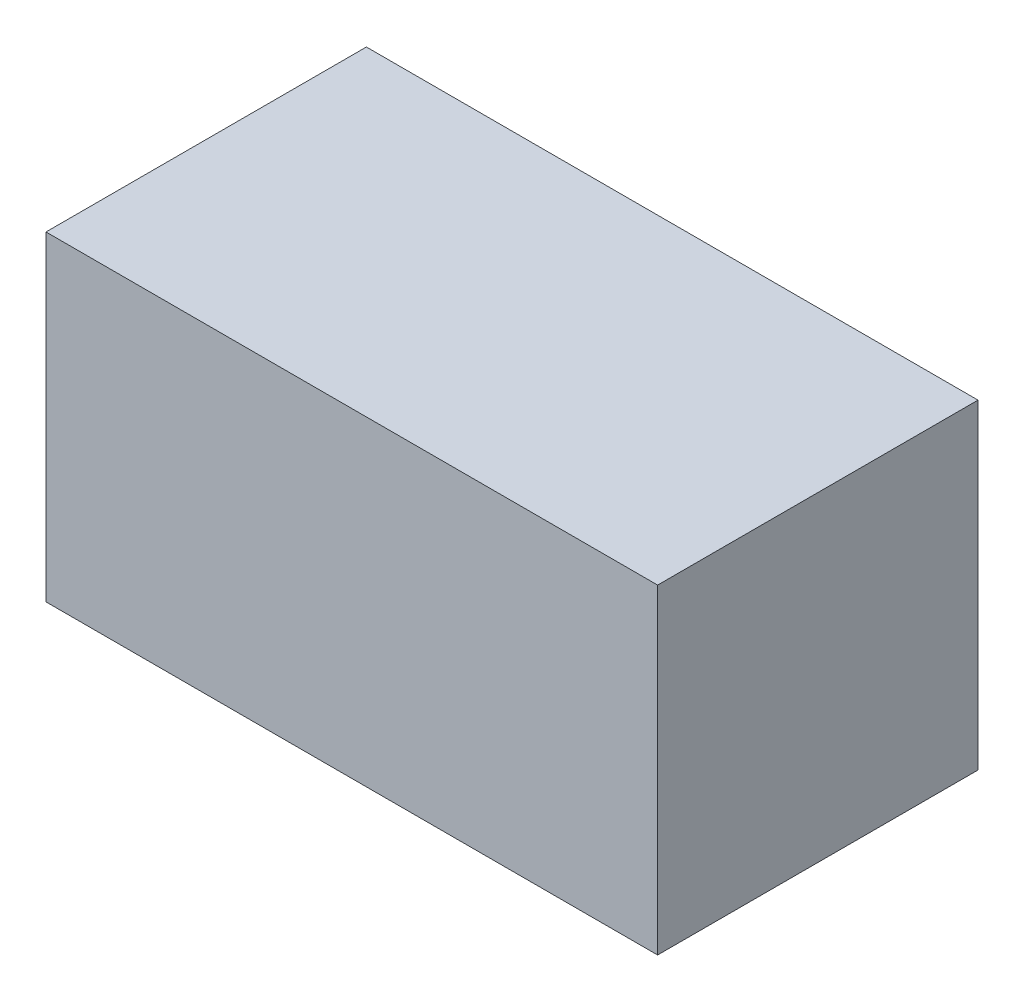
ISO-10303-21;
HEADER;
FILE_DESCRIPTION(('STEP AP214'),'2;1');
FILE_NAME('part.step','',(''),(''),'','','');
FILE_SCHEMA(('AUTOMOTIVE_DESIGN { 1 0 10303 214 1 1 1 1 }'));
ENDSEC;
DATA;
#1=APPLICATION_CONTEXT('core data for automotive mechanical design processes');
#2=APPLICATION_PROTOCOL_DEFINITION('international standard','automotive_design',2000,#1);
#3=PRODUCT_CONTEXT('',#1,'mechanical');
#4=PRODUCT('Part','Part','',(#3));
#5=PRODUCT_RELATED_PRODUCT_CATEGORY('part','',(#4));
#6=PRODUCT_DEFINITION_FORMATION('','',#4);
#7=PRODUCT_DEFINITION_CONTEXT('part definition',#1,'design');
#8=PRODUCT_DEFINITION('design','',#6,#7);
#9=PRODUCT_DEFINITION_SHAPE('','',#8);
#10=(LENGTH_UNIT() NAMED_UNIT(*) SI_UNIT(.MILLI.,.METRE.));
#11=(NAMED_UNIT(*) PLANE_ANGLE_UNIT() SI_UNIT($,.RADIAN.));
#12=(NAMED_UNIT(*) SI_UNIT($,.STERADIAN.) SOLID_ANGLE_UNIT());
#13=UNCERTAINTY_MEASURE_WITH_UNIT(LENGTH_MEASURE(1.E-05),#10,'distance_accuracy_value','');
#14=(GEOMETRIC_REPRESENTATION_CONTEXT(3) GLOBAL_UNCERTAINTY_ASSIGNED_CONTEXT((#13)) GLOBAL_UNIT_ASSIGNED_CONTEXT((#10,
#11,#12)) REPRESENTATION_CONTEXT('',''));
#15=CARTESIAN_POINT('',(0.,0.,0.));
#16=DIRECTION('',(0.,0.,1.));
#17=DIRECTION('',(1.,0.,0.));
#18=AXIS2_PLACEMENT_3D('',#15,#16,#17);
#19=CARTESIAN_POINT('',(-0.3149981,0.16500094,0.));
#20=DIRECTION('',(1.,0.,0.));
#21=DIRECTION('',(0.,-1.,0.));
#22=AXIS2_PLACEMENT_3D('',#19,#20,#21);
#23=PLANE('',#22);
#24=DIRECTION('',(0.,-1.,0.));
#25=VECTOR('',#24,1.);
#26=CARTESIAN_POINT('',(-0.3149981,0.16500094,0.));
#27=LINE('',#26,#25);
#28=CARTESIAN_POINT('',(-0.3149981,0.16500094,0.));
#29=VERTEX_POINT('',#28);
#30=CARTESIAN_POINT('',(-0.3149981,-0.16500094,0.));
#31=VERTEX_POINT('',#30);
#32=EDGE_CURVE('E11',#29,#31,#27,.T.);
#33=ORIENTED_EDGE('',*,*,#32,.T.);
#34=DIRECTION('',(0.,0.,1.));
#35=VECTOR('',#34,1.);
#36=CARTESIAN_POINT('',(-0.3149981,-0.16500094,0.));
#37=LINE('',#36,#35);
#38=CARTESIAN_POINT('',(-0.3149981,-0.16500094,0.32999934));
#39=VERTEX_POINT('',#38);
#40=EDGE_CURVE('E24',#31,#39,#37,.T.);
#41=ORIENTED_EDGE('',*,*,#40,.T.);
#42=DIRECTION('',(0.,-1.,0.));
#43=VECTOR('',#42,1.);
#44=CARTESIAN_POINT('',(-0.3149981,0.16500094,0.32999934));
#45=LINE('',#44,#43);
#46=CARTESIAN_POINT('',(-0.3149981,0.16500094,0.32999934));
#47=VERTEX_POINT('',#46);
#48=EDGE_CURVE('E87',#47,#39,#45,.T.);
#49=ORIENTED_EDGE('',*,*,#48,.F.);
#50=DIRECTION('',(0.,0.,1.));
#51=VECTOR('',#50,1.);
#52=CARTESIAN_POINT('',(-0.3149981,0.16500094,0.));
#53=LINE('',#52,#51);
#54=EDGE_CURVE('E36',#29,#47,#53,.T.);
#55=ORIENTED_EDGE('',*,*,#54,.F.);
#56=EDGE_LOOP('',(#33,#41,#49,#55));
#57=FACE_BOUND('',#56,.T.);
#58=ADVANCED_FACE('F17',(#57),#23,.F.);
#59=CARTESIAN_POINT('',(-0.3149981,-0.16500094,0.));
#60=DIRECTION('',(0.,1.,0.));
#61=DIRECTION('',(1.,0.,0.));
#62=AXIS2_PLACEMENT_3D('',#59,#60,#61);
#63=PLANE('',#62);
#64=DIRECTION('',(1.,0.,0.));
#65=VECTOR('',#64,1.);
#66=CARTESIAN_POINT('',(-0.3149981,-0.16500094,0.));
#67=LINE('',#66,#65);
#68=CARTESIAN_POINT('',(0.31500064,-0.16500094,0.));
#69=VERTEX_POINT('',#68);
#70=EDGE_CURVE('E84',#31,#69,#67,.T.);
#71=ORIENTED_EDGE('',*,*,#70,.T.);
#72=DIRECTION('',(0.,0.,1.));
#73=VECTOR('',#72,1.);
#74=CARTESIAN_POINT('',(0.31500064,-0.16500094,0.));
#75=LINE('',#74,#73);
#76=CARTESIAN_POINT('',(0.31500064,-0.16500094,0.32999934));
#77=VERTEX_POINT('',#76);
#78=EDGE_CURVE('E82',#69,#77,#75,.T.);
#79=ORIENTED_EDGE('',*,*,#78,.T.);
#80=DIRECTION('',(1.,0.,0.));
#81=VECTOR('',#80,1.);
#82=CARTESIAN_POINT('',(-0.3149981,-0.16500094,0.32999934));
#83=LINE('',#82,#81);
#84=EDGE_CURVE('E69',#39,#77,#83,.T.);
#85=ORIENTED_EDGE('',*,*,#84,.F.);
#86=ORIENTED_EDGE('',*,*,#40,.F.);
#87=EDGE_LOOP('',(#71,#79,#85,#86));
#88=FACE_BOUND('',#87,.T.);
#89=ADVANCED_FACE('F89',(#88),#63,.F.);
#90=CARTESIAN_POINT('',(0.31500064,-0.16500094,0.));
#91=DIRECTION('',(-1.,0.,0.));
#92=DIRECTION('',(0.,1.,0.));
#93=AXIS2_PLACEMENT_3D('',#90,#91,#92);
#94=PLANE('',#93);
#95=DIRECTION('',(0.,1.,0.));
#96=VECTOR('',#95,1.);
#97=CARTESIAN_POINT('',(0.31500064,-0.16500094,0.));
#98=LINE('',#97,#96);
#99=CARTESIAN_POINT('',(0.31500064,0.16500094,0.));
#100=VERTEX_POINT('',#99);
#101=EDGE_CURVE('E75',#69,#100,#98,.T.);
#102=ORIENTED_EDGE('',*,*,#101,.T.);
#103=DIRECTION('',(0.,0.,1.));
#104=VECTOR('',#103,1.);
#105=CARTESIAN_POINT('',(0.31500064,0.16500094,0.));
#106=LINE('',#105,#104);
#107=CARTESIAN_POINT('',(0.31500064,0.16500094,0.32999934));
#108=VERTEX_POINT('',#107);
#109=EDGE_CURVE('E62',#100,#108,#106,.T.);
#110=ORIENTED_EDGE('',*,*,#109,.T.);
#111=DIRECTION('',(0.,1.,0.));
#112=VECTOR('',#111,1.);
#113=CARTESIAN_POINT('',(0.31500064,-0.16500094,0.32999934));
#114=LINE('',#113,#112);
#115=EDGE_CURVE('E67',#77,#108,#114,.T.);
#116=ORIENTED_EDGE('',*,*,#115,.F.);
#117=ORIENTED_EDGE('',*,*,#78,.F.);
#118=EDGE_LOOP('',(#102,#110,#116,#117));
#119=FACE_BOUND('',#118,.T.);
#120=ADVANCED_FACE('F73',(#119),#94,.F.);
#121=CARTESIAN_POINT('',(0.31500064,0.16500094,0.));
#122=DIRECTION('',(0.,-1.,0.));
#123=DIRECTION('',(-1.,0.,0.));
#124=AXIS2_PLACEMENT_3D('',#121,#122,#123);
#125=PLANE('',#124);
#126=DIRECTION('',(-1.,0.,0.));
#127=VECTOR('',#126,1.);
#128=CARTESIAN_POINT('',(0.31500064,0.16500094,0.));
#129=LINE('',#128,#127);
#130=EDGE_CURVE('E64',#100,#29,#129,.T.);
#131=ORIENTED_EDGE('',*,*,#130,.T.);
#132=ORIENTED_EDGE('',*,*,#54,.T.);
#133=DIRECTION('',(-1.,0.,0.));
#134=VECTOR('',#133,1.);
#135=CARTESIAN_POINT('',(0.31500064,0.16500094,0.32999934));
#136=LINE('',#135,#134);
#137=EDGE_CURVE('E57',#108,#47,#136,.T.);
#138=ORIENTED_EDGE('',*,*,#137,.F.);
#139=ORIENTED_EDGE('',*,*,#109,.F.);
#140=EDGE_LOOP('',(#131,#132,#138,#139));
#141=FACE_BOUND('',#140,.T.);
#142=ADVANCED_FACE('F60',(#141),#125,.F.);
#143=CARTESIAN_POINT('',(-0.3149981,0.16500094,0.));
#144=DIRECTION('',(0.,0.,-1.));
#145=DIRECTION('',(-1.,0.,0.));
#146=AXIS2_PLACEMENT_3D('',#143,#144,#145);
#147=PLANE('',#146);
#148=ORIENTED_EDGE('',*,*,#130,.F.);
#149=ORIENTED_EDGE('',*,*,#101,.F.);
#150=ORIENTED_EDGE('',*,*,#70,.F.);
#151=ORIENTED_EDGE('',*,*,#32,.F.);
#152=EDGE_LOOP('',(#148,#149,#150,#151));
#153=FACE_BOUND('',#152,.T.);
#154=ADVANCED_FACE('F91',(#153),#147,.T.);
#155=CARTESIAN_POINT('',(-0.3149981,0.16500094,0.32999934));
#156=DIRECTION('',(0.,0.,-1.));
#157=DIRECTION('',(-1.,0.,0.));
#158=AXIS2_PLACEMENT_3D('',#155,#156,#157);
#159=PLANE('',#158);
#160=ORIENTED_EDGE('',*,*,#48,.T.);
#161=ORIENTED_EDGE('',*,*,#84,.T.);
#162=ORIENTED_EDGE('',*,*,#115,.T.);
#163=ORIENTED_EDGE('',*,*,#137,.T.);
#164=EDGE_LOOP('',(#160,#161,#162,#163));
#165=FACE_BOUND('',#164,.T.);
#166=ADVANCED_FACE('F68',(#165),#159,.F.);
#167=CLOSED_SHELL('',(#58,#89,#120,#142,#154,#166));
#168=MANIFOLD_SOLID_BREP('B1',#167);
#169=ADVANCED_BREP_SHAPE_REPRESENTATION('',(#18,#168),#14);
#170=SHAPE_DEFINITION_REPRESENTATION(#9,#169);
ENDSEC;
END-ISO-10303-21;
